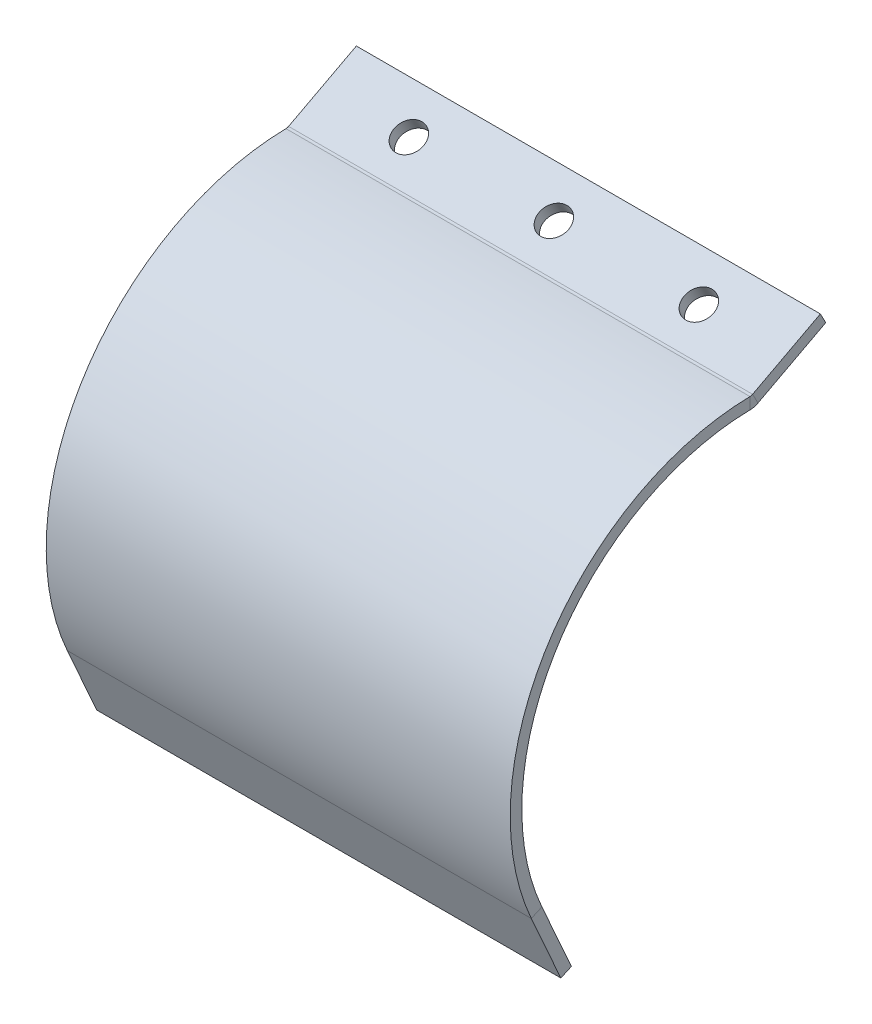
ISO-10303-21;
HEADER;
FILE_DESCRIPTION(('STEP AP214'),'2;1');
FILE_NAME('part.step','',(''),(''),'','','');
FILE_SCHEMA(('AUTOMOTIVE_DESIGN { 1 0 10303 214 1 1 1 1 }'));
ENDSEC;
DATA;
#1=APPLICATION_CONTEXT('core data for automotive mechanical design processes');
#2=APPLICATION_PROTOCOL_DEFINITION('international standard','automotive_design',2000,#1);
#3=PRODUCT_CONTEXT('',#1,'mechanical');
#4=PRODUCT('Part','Part','',(#3));
#5=PRODUCT_RELATED_PRODUCT_CATEGORY('part','',(#4));
#6=PRODUCT_DEFINITION_FORMATION('','',#4);
#7=PRODUCT_DEFINITION_CONTEXT('part definition',#1,'design');
#8=PRODUCT_DEFINITION('design','',#6,#7);
#9=PRODUCT_DEFINITION_SHAPE('','',#8);
#10=(LENGTH_UNIT() NAMED_UNIT(*) SI_UNIT(.MILLI.,.METRE.));
#11=(NAMED_UNIT(*) PLANE_ANGLE_UNIT() SI_UNIT($,.RADIAN.));
#12=(NAMED_UNIT(*) SI_UNIT($,.STERADIAN.) SOLID_ANGLE_UNIT());
#13=UNCERTAINTY_MEASURE_WITH_UNIT(LENGTH_MEASURE(1.E-05),#10,'distance_accuracy_value','');
#14=(GEOMETRIC_REPRESENTATION_CONTEXT(3) GLOBAL_UNCERTAINTY_ASSIGNED_CONTEXT((#13)) GLOBAL_UNIT_ASSIGNED_CONTEXT((#10,
#11,#12)) REPRESENTATION_CONTEXT('',''));
#15=CARTESIAN_POINT('',(0.,0.,0.));
#16=DIRECTION('',(0.,0.,1.));
#17=DIRECTION('',(1.,0.,0.));
#18=AXIS2_PLACEMENT_3D('',#15,#16,#17);
#19=CARTESIAN_POINT('',(80.,-8.33097741460882,-104.091630430719));
#20=DIRECTION('',(0.,0.9135454576426,0.406736643075803));
#21=DIRECTION('',(0.,-0.406736643075803,0.9135454576426));
#22=AXIS2_PLACEMENT_3D('',#19,#20,#21);
#23=PLANE('',#22);
#24=DIRECTION('',(0.,-0.406736643075803,0.9135454576426));
#25=VECTOR('',#24,1.);
#26=CARTESIAN_POINT('',(80.,-8.33097741460882,-104.091630430719));
#27=LINE('',#26,#25);
#28=CARTESIAN_POINT('',(80.,-74.2,43.8526165571953));
#29=VERTEX_POINT('',#28);
#30=CARTESIAN_POINT('',(80.,-75.0134732861516,45.6797074724806));
#31=VERTEX_POINT('',#30);
#32=EDGE_CURVE('E153',#29,#31,#27,.T.);
#33=ORIENTED_EDGE('',*,*,#32,.T.);
#34=DIRECTION('',(-1.,0.,0.));
#35=VECTOR('',#34,1.);
#36=CARTESIAN_POINT('',(80.,-75.0134732861516,45.6797074724806));
#37=LINE('',#36,#35);
#38=CARTESIAN_POINT('',(0.,-75.0134732861516,45.6797074724805));
#39=VERTEX_POINT('',#38);
#40=EDGE_CURVE('E145',#31,#39,#37,.T.);
#41=ORIENTED_EDGE('',*,*,#40,.T.);
#42=DIRECTION('',(0.,-0.406736643075803,0.9135454576426));
#43=VECTOR('',#42,1.);
#44=CARTESIAN_POINT('',(0.,-8.33097741460882,-104.091630430719));
#45=LINE('',#44,#43);
#46=CARTESIAN_POINT('',(0.,-74.2,43.8526165571954));
#47=VERTEX_POINT('',#46);
#48=EDGE_CURVE('E75',#47,#39,#45,.T.);
#49=ORIENTED_EDGE('',*,*,#48,.F.);
#50=DIRECTION('',(-1.,0.,0.));
#51=VECTOR('',#50,1.);
#52=CARTESIAN_POINT('',(80.,-74.2,43.8526165571954));
#53=LINE('',#52,#51);
#54=EDGE_CURVE('E11',#29,#47,#53,.T.);
#55=ORIENTED_EDGE('',*,*,#54,.F.);
#56=EDGE_LOOP('',(#33,#41,#49,#55));
#57=FACE_BOUND('',#56,.T.);
#58=ADVANCED_FACE('F37',(#57),#23,.F.);
#59=CARTESIAN_POINT('',(80.,3.09955686235903,-99.0024286822107));
#60=DIRECTION('',(-1.,0.,0.));
#61=DIRECTION('',(0.,-0.99780146829205,0.0662739003999978));
#62=AXIS2_PLACEMENT_3D('',#59,#60,#61);
#63=PLANE('',#62);
#64=DIRECTION('',(0.,-0.406736643075803,0.9135454576426));
#65=VECTOR('',#64,1.);
#66=CARTESIAN_POINT('',(80.,3.09955686235905,-99.0024286822107));
#67=LINE('',#66,#65);
#68=CARTESIAN_POINT('',(80.,-62.7694657230321,48.941818305704));
#69=VERTEX_POINT('',#68);
#70=CARTESIAN_POINT('',(80.,-63.5829390091838,50.7689092209892));
#71=VERTEX_POINT('',#70);
#72=EDGE_CURVE('E136',#69,#71,#67,.T.);
#73=ORIENTED_EDGE('',*,*,#72,.T.);
#74=DIRECTION('',(0.,-0.9135454576426,-0.406736643075803));
#75=VECTOR('',#74,1.);
#76=CARTESIAN_POINT('',(80.,-63.5829390091838,50.7689092209892));
#77=LINE('',#76,#75);
#78=EDGE_CURVE('E143',#71,#31,#77,.T.);
#79=ORIENTED_EDGE('',*,*,#78,.T.);
#80=ORIENTED_EDGE('',*,*,#32,.F.);
#81=DIRECTION('',(0.,-0.9135454576426,-0.406736643075803));
#82=VECTOR('',#81,1.);
#83=CARTESIAN_POINT('',(80.,-62.7694657230322,48.9418183057039));
#84=LINE('',#83,#82);
#85=EDGE_CURVE('E47',#69,#29,#84,.T.);
#86=ORIENTED_EDGE('',*,*,#85,.F.);
#87=EDGE_LOOP('',(#73,#79,#80,#86));
#88=FACE_BOUND('',#87,.T.);
#89=ADVANCED_FACE('F149',(#88),#63,.F.);
#90=CARTESIAN_POINT('',(80.,-63.5829390091838,50.7689092209892));
#91=DIRECTION('',(0.,0.406736643075803,-0.9135454576426));
#92=DIRECTION('',(0.,0.9135454576426,0.406736643075803));
#93=AXIS2_PLACEMENT_3D('',#90,#91,#92);
#94=PLANE('',#93);
#95=DIRECTION('',(0.,-0.9135454576426,-0.406736643075803));
#96=VECTOR('',#95,1.);
#97=CARTESIAN_POINT('',(0.,-63.5829390091838,50.7689092209892));
#98=LINE('',#97,#96);
#99=CARTESIAN_POINT('',(0.,-63.5829390091837,50.7689092209892));
#100=VERTEX_POINT('',#99);
#101=EDGE_CURVE('E129',#100,#39,#98,.T.);
#102=ORIENTED_EDGE('',*,*,#101,.T.);
#103=ORIENTED_EDGE('',*,*,#40,.F.);
#104=ORIENTED_EDGE('',*,*,#78,.F.);
#105=DIRECTION('',(-1.,0.,0.));
#106=VECTOR('',#105,1.);
#107=CARTESIAN_POINT('',(80.,-63.5829390091838,50.7689092209892));
#108=LINE('',#107,#106);
#109=EDGE_CURVE('E122',#71,#100,#108,.T.);
#110=ORIENTED_EDGE('',*,*,#109,.T.);
#111=EDGE_LOOP('',(#102,#103,#104,#110));
#112=FACE_BOUND('',#111,.T.);
#113=ADVANCED_FACE('F144',(#112),#94,.F.);
#114=CARTESIAN_POINT('',(0.,3.09955686235903,-99.0024286822107));
#115=DIRECTION('',(-1.,0.,0.));
#116=DIRECTION('',(0.,-0.99780146829205,0.0662739003999978));
#117=AXIS2_PLACEMENT_3D('',#114,#115,#116);
#118=PLANE('',#117);
#119=ORIENTED_EDGE('',*,*,#101,.F.);
#120=DIRECTION('',(0.,-0.406736643075803,0.9135454576426));
#121=VECTOR('',#120,1.);
#122=CARTESIAN_POINT('',(0.,3.09955686235905,-99.0024286822107));
#123=LINE('',#122,#121);
#124=CARTESIAN_POINT('',(0.,-62.7694657230321,48.941818305704));
#125=VERTEX_POINT('',#124);
#126=EDGE_CURVE('E157',#125,#100,#123,.T.);
#127=ORIENTED_EDGE('',*,*,#126,.F.);
#128=DIRECTION('',(0.,-0.9135454576426,-0.406736643075803));
#129=VECTOR('',#128,1.);
#130=CARTESIAN_POINT('',(0.,-62.7694657230322,48.9418183057039));
#131=LINE('',#130,#129);
#132=EDGE_CURVE('E128',#125,#47,#131,.T.);
#133=ORIENTED_EDGE('',*,*,#132,.T.);
#134=ORIENTED_EDGE('',*,*,#48,.T.);
#135=EDGE_LOOP('',(#119,#127,#133,#134));
#136=FACE_BOUND('',#135,.T.);
#137=ADVANCED_FACE('F174',(#136),#118,.T.);
#138=CARTESIAN_POINT('',(80.,-62.7694657230322,48.9418183057039));
#139=DIRECTION('',(0.,0.406736643075803,-0.9135454576426));
#140=DIRECTION('',(0.,0.9135454576426,0.406736643075803));
#141=AXIS2_PLACEMENT_3D('',#138,#139,#140);
#142=PLANE('',#141);
#143=ORIENTED_EDGE('',*,*,#132,.F.);
#144=DIRECTION('',(-1.,0.,0.));
#145=VECTOR('',#144,1.);
#146=CARTESIAN_POINT('',(80.,-62.7694657230321,48.941818305704));
#147=LINE('',#146,#145);
#148=EDGE_CURVE('E41',#69,#125,#147,.T.);
#149=ORIENTED_EDGE('',*,*,#148,.F.);
#150=ORIENTED_EDGE('',*,*,#85,.T.);
#151=ORIENTED_EDGE('',*,*,#54,.T.);
#152=EDGE_LOOP('',(#143,#149,#150,#151));
#153=FACE_BOUND('',#152,.T.);
#154=ADVANCED_FACE('F39',(#153),#142,.T.);
#155=CARTESIAN_POINT('',(65.,-1.36650649129364,6.88009768540492));
#156=DIRECTION('',(0.,0.884580975215083,0.466386640339892));
#157=DIRECTION('',(0.,-0.466386640339892,0.884580975215083));
#158=AXIS2_PLACEMENT_3D('',#155,#156,#157);
#159=CYLINDRICAL_SURFACE('',#158,2.54999999999998);
#160=CARTESIAN_POINT('',(65.,-3.1356684417238,5.94732440472513));
#161=DIRECTION('',(0.,-0.884580975215083,-0.466386640339892));
#162=DIRECTION('',(0.,0.466386640339892,-0.884580975215084));
#163=AXIS2_PLACEMENT_3D('',#160,#161,#162);
#164=CIRCLE('',#163,2.54999999999998);
#165=CARTESIAN_POINT('',(65.,-1.94638250885709,3.69164291792668));
#166=VERTEX_POINT('',#165);
#167=EDGE_CURVE('E405',#166,#166,#164,.T.);
#168=ORIENTED_EDGE('',*,*,#167,.T.);
#169=EDGE_LOOP('',(#168));
#170=FACE_BOUND('',#169,.T.);
#171=CARTESIAN_POINT('',(65.,-1.36650649129364,6.88009768540492));
#172=DIRECTION('',(0.,0.884580975215083,0.466386640339892));
#173=DIRECTION('',(0.,-0.466386640339892,0.884580975215083));
#174=AXIS2_PLACEMENT_3D('',#171,#172,#173);
#175=CIRCLE('',#174,2.54999999999998);
#176=CARTESIAN_POINT('',(65.,-2.55579242416035,9.13577917220337));
#177=VERTEX_POINT('',#176);
#178=EDGE_CURVE('E451',#177,#177,#175,.T.);
#179=ORIENTED_EDGE('',*,*,#178,.T.);
#180=EDGE_LOOP('',(#179));
#181=FACE_BOUND('',#180,.T.);
#182=ADVANCED_FACE('F178',(#170,#181),#159,.F.);
#183=CARTESIAN_POINT('',(40.,-1.36650649129364,6.88009768540492));
#184=DIRECTION('',(0.,0.884580975215083,0.466386640339892));
#185=DIRECTION('',(0.,-0.466386640339892,0.884580975215083));
#186=AXIS2_PLACEMENT_3D('',#183,#184,#185);
#187=CYLINDRICAL_SURFACE('',#186,2.54999999999999);
#188=CARTESIAN_POINT('',(40.,-3.1356684417238,5.94732440472513));
#189=DIRECTION('',(0.,-0.884580975215083,-0.466386640339892));
#190=DIRECTION('',(0.,0.466386640339892,-0.884580975215084));
#191=AXIS2_PLACEMENT_3D('',#188,#189,#190);
#192=CIRCLE('',#191,2.54999999999999);
#193=CARTESIAN_POINT('',(40.,-1.94638250885709,3.69164291792668));
#194=VERTEX_POINT('',#193);
#195=EDGE_CURVE('E401',#194,#194,#192,.T.);
#196=ORIENTED_EDGE('',*,*,#195,.T.);
#197=EDGE_LOOP('',(#196));
#198=FACE_BOUND('',#197,.T.);
#199=CARTESIAN_POINT('',(40.,-1.36650649129364,6.88009768540492));
#200=DIRECTION('',(0.,0.884580975215083,0.466386640339892));
#201=DIRECTION('',(0.,-0.466386640339892,0.884580975215083));
#202=AXIS2_PLACEMENT_3D('',#199,#200,#201);
#203=CIRCLE('',#202,2.54999999999999);
#204=CARTESIAN_POINT('',(40.,-2.55579242416036,9.13577917220337));
#205=VERTEX_POINT('',#204);
#206=EDGE_CURVE('E447',#205,#205,#203,.T.);
#207=ORIENTED_EDGE('',*,*,#206,.T.);
#208=EDGE_LOOP('',(#207));
#209=FACE_BOUND('',#208,.T.);
#210=ADVANCED_FACE('F183',(#198,#209),#187,.F.);
#211=CARTESIAN_POINT('',(15.,-1.36650649129364,6.88009768540492));
#212=DIRECTION('',(0.,0.884580975215083,0.466386640339892));
#213=DIRECTION('',(0.,-0.466386640339892,0.884580975215083));
#214=AXIS2_PLACEMENT_3D('',#211,#212,#213);
#215=CYLINDRICAL_SURFACE('',#214,2.54999999999999);
#216=CARTESIAN_POINT('',(15.,-3.1356684417238,5.94732440472513));
#217=DIRECTION('',(0.,-0.884580975215083,-0.466386640339892));
#218=DIRECTION('',(0.,0.466386640339892,-0.884580975215084));
#219=AXIS2_PLACEMENT_3D('',#216,#217,#218);
#220=CIRCLE('',#219,2.54999999999999);
#221=CARTESIAN_POINT('',(15.,-1.94638250885709,3.69164291792668));
#222=VERTEX_POINT('',#221);
#223=EDGE_CURVE('E397',#222,#222,#220,.T.);
#224=ORIENTED_EDGE('',*,*,#223,.T.);
#225=EDGE_LOOP('',(#224));
#226=FACE_BOUND('',#225,.T.);
#227=CARTESIAN_POINT('',(15.,-1.36650649129364,6.88009768540492));
#228=DIRECTION('',(0.,0.884580975215083,0.466386640339892));
#229=DIRECTION('',(0.,-0.466386640339892,0.884580975215083));
#230=AXIS2_PLACEMENT_3D('',#227,#228,#229);
#231=CIRCLE('',#230,2.54999999999999);
#232=CARTESIAN_POINT('',(15.,-2.55579242416036,9.13577917220337));
#233=VERTEX_POINT('',#232);
#234=EDGE_CURVE('E443',#233,#233,#231,.T.);
#235=ORIENTED_EDGE('',*,*,#234,.T.);
#236=EDGE_LOOP('',(#235));
#237=FACE_BOUND('',#236,.T.);
#238=ADVANCED_FACE('F220',(#226,#237),#215,.F.);
#239=CARTESIAN_POINT('',(80.,143.44838529191,75.6317537376489));
#240=DIRECTION('',(0.,-0.466386640339892,0.884580975215083));
#241=DIRECTION('',(0.,-0.884580975215084,-0.466386640339892));
#242=AXIS2_PLACEMENT_3D('',#239,#240,#241);
#243=PLANE('',#242);
#244=DIRECTION('',(-1.,0.,0.));
#245=VECTOR('',#244,1.);
#246=CARTESIAN_POINT('',(80.,0.,0.));
#247=LINE('',#246,#245);
#248=CARTESIAN_POINT('',(80.,0.,0.));
#249=VERTEX_POINT('',#248);
#250=CARTESIAN_POINT('',(0.,0.,0.));
#251=VERTEX_POINT('',#250);
#252=EDGE_CURVE('E415',#249,#251,#247,.T.);
#253=ORIENTED_EDGE('',*,*,#252,.T.);
#254=DIRECTION('',(0.,-0.884580975215083,-0.466386640339892));
#255=VECTOR('',#254,1.);
#256=CARTESIAN_POINT('',(0.,143.44838529191,75.6317537376489));
#257=LINE('',#256,#255);
#258=CARTESIAN_POINT('',(0.,1.76916195043017,0.932773280679784));
#259=VERTEX_POINT('',#258);
#260=EDGE_CURVE('E435',#259,#251,#257,.T.);
#261=ORIENTED_EDGE('',*,*,#260,.F.);
#262=DIRECTION('',(-1.,0.,0.));
#263=VECTOR('',#262,1.);
#264=CARTESIAN_POINT('',(80.,1.76916195043017,0.932773280679784));
#265=LINE('',#264,#263);
#266=CARTESIAN_POINT('',(80.,1.76916195043014,0.932773280679769));
#267=VERTEX_POINT('',#266);
#268=EDGE_CURVE('E427',#267,#259,#265,.T.);
#269=ORIENTED_EDGE('',*,*,#268,.F.);
#270=DIRECTION('',(0.,-0.884580975215083,-0.466386640339892));
#271=VECTOR('',#270,1.);
#272=CARTESIAN_POINT('',(80.,143.44838529191,75.6317537376489));
#273=LINE('',#272,#271);
#274=EDGE_CURVE('E440',#267,#249,#273,.T.);
#275=ORIENTED_EDGE('',*,*,#274,.T.);
#276=EDGE_LOOP('',(#253,#261,#269,#275));
#277=FACE_BOUND('',#276,.T.);
#278=ADVANCED_FACE('F215',(#277),#243,.F.);
#279=CARTESIAN_POINT('',(0.,143.44838529191,75.6317537376489));
#280=DIRECTION('',(1.,0.,0.));
#281=DIRECTION('',(0.,0.,-1.));
#282=AXIS2_PLACEMENT_3D('',#279,#280,#281);
#283=PLANE('',#282);
#284=DIRECTION('',(0.,-0.466386640339892,0.884580975215083));
#285=VECTOR('',#284,1.);
#286=CARTESIAN_POINT('',(0.,0.,0.));
#287=LINE('',#286,#285);
#288=CARTESIAN_POINT('',(0.,-6.1591358418114,11.6818405978806));
#289=VERTEX_POINT('',#288);
#290=EDGE_CURVE('E438',#251,#289,#287,.T.);
#291=ORIENTED_EDGE('',*,*,#290,.T.);
#292=DIRECTION('',(0.,-0.884580975215083,-0.466386640339892));
#293=VECTOR('',#292,1.);
#294=CARTESIAN_POINT('',(0.,137.289249450099,87.3135943355295));
#295=LINE('',#294,#293);
#296=CARTESIAN_POINT('',(0.,-4.38997389138123,12.6146138785604));
#297=VERTEX_POINT('',#296);
#298=EDGE_CURVE('E455',#297,#289,#295,.T.);
#299=ORIENTED_EDGE('',*,*,#298,.F.);
#300=DIRECTION('',(0.,-0.466386640339892,0.884580975215084));
#301=VECTOR('',#300,1.);
#302=CARTESIAN_POINT('',(0.,1.76916195043017,0.932773280679784));
#303=LINE('',#302,#301);
#304=EDGE_CURVE('E432',#259,#297,#303,.T.);
#305=ORIENTED_EDGE('',*,*,#304,.F.);
#306=ORIENTED_EDGE('',*,*,#260,.T.);
#307=EDGE_LOOP('',(#291,#299,#305,#306));
#308=FACE_BOUND('',#307,.T.);
#309=ADVANCED_FACE('F219',(#308),#283,.F.);
#310=CARTESIAN_POINT('',(80.,1.76916195043017,0.932773280679784));
#311=DIRECTION('',(0.,-0.884580975215083,-0.466386640339892));
#312=DIRECTION('',(0.,0.466386640339892,-0.884580975215083));
#313=AXIS2_PLACEMENT_3D('',#310,#311,#312);
#314=PLANE('',#313);
#315=ORIENTED_EDGE('',*,*,#234,.F.);
#316=EDGE_LOOP('',(#315));
#317=FACE_BOUND('',#316,.T.);
#318=ORIENTED_EDGE('',*,*,#206,.F.);
#319=EDGE_LOOP('',(#318));
#320=FACE_BOUND('',#319,.T.);
#321=ORIENTED_EDGE('',*,*,#178,.F.);
#322=EDGE_LOOP('',(#321));
#323=FACE_BOUND('',#322,.T.);
#324=ORIENTED_EDGE('',*,*,#304,.T.);
#325=DIRECTION('',(1.,0.,0.));
#326=VECTOR('',#325,1.);
#327=CARTESIAN_POINT('',(80.,-4.38997389138123,12.6146138785604));
#328=LINE('',#327,#326);
#329=CARTESIAN_POINT('',(80.,-4.38997389138123,12.6146138785604));
#330=VERTEX_POINT('',#329);
#331=EDGE_CURVE('E429',#297,#330,#328,.T.);
#332=ORIENTED_EDGE('',*,*,#331,.T.);
#333=DIRECTION('',(0.,-0.466386640339892,0.884580975215084));
#334=VECTOR('',#333,1.);
#335=CARTESIAN_POINT('',(80.,1.76916195043017,0.932773280679784));
#336=LINE('',#335,#334);
#337=EDGE_CURVE('E418',#267,#330,#336,.T.);
#338=ORIENTED_EDGE('',*,*,#337,.F.);
#339=ORIENTED_EDGE('',*,*,#268,.T.);
#340=EDGE_LOOP('',(#324,#332,#338,#339));
#341=FACE_BOUND('',#340,.T.);
#342=ADVANCED_FACE('F229',(#317,#320,#323,#341),#314,.F.);
#343=CARTESIAN_POINT('',(80.,143.44838529191,75.6317537376489));
#344=DIRECTION('',(1.,0.,0.));
#345=DIRECTION('',(0.,0.,-1.));
#346=AXIS2_PLACEMENT_3D('',#343,#344,#345);
#347=PLANE('',#346);
#348=DIRECTION('',(0.,-0.884580975215083,-0.466386640339892));
#349=VECTOR('',#348,1.);
#350=CARTESIAN_POINT('',(80.,137.289249450099,87.3135943355295));
#351=LINE('',#350,#349);
#352=CARTESIAN_POINT('',(80.,-6.1591358418114,11.6818405978806));
#353=VERTEX_POINT('',#352);
#354=EDGE_CURVE('E422',#330,#353,#351,.T.);
#355=ORIENTED_EDGE('',*,*,#354,.T.);
#356=DIRECTION('',(0.,-0.466386640339892,0.884580975215083));
#357=VECTOR('',#356,1.);
#358=CARTESIAN_POINT('',(80.,0.,0.));
#359=LINE('',#358,#357);
#360=EDGE_CURVE('E410',#249,#353,#359,.T.);
#361=ORIENTED_EDGE('',*,*,#360,.F.);
#362=ORIENTED_EDGE('',*,*,#274,.F.);
#363=ORIENTED_EDGE('',*,*,#337,.T.);
#364=EDGE_LOOP('',(#355,#361,#362,#363));
#365=FACE_BOUND('',#364,.T.);
#366=ADVANCED_FACE('F235',(#365),#347,.T.);
#367=CARTESIAN_POINT('',(80.,0.,0.));
#368=DIRECTION('',(0.,-0.884580975215083,-0.466386640339892));
#369=DIRECTION('',(0.,0.466386640339892,-0.884580975215084));
#370=AXIS2_PLACEMENT_3D('',#367,#368,#369);
#371=PLANE('',#370);
#372=ORIENTED_EDGE('',*,*,#223,.F.);
#373=EDGE_LOOP('',(#372));
#374=FACE_BOUND('',#373,.T.);
#375=ORIENTED_EDGE('',*,*,#195,.F.);
#376=EDGE_LOOP('',(#375));
#377=FACE_BOUND('',#376,.T.);
#378=ORIENTED_EDGE('',*,*,#167,.F.);
#379=EDGE_LOOP('',(#378));
#380=FACE_BOUND('',#379,.T.);
#381=ORIENTED_EDGE('',*,*,#360,.T.);
#382=DIRECTION('',(-1.,0.,0.));
#383=VECTOR('',#382,1.);
#384=CARTESIAN_POINT('',(80.,-6.15913584181139,11.6818405978806));
#385=LINE('',#384,#383);
#386=EDGE_CURVE('E413',#353,#289,#385,.T.);
#387=ORIENTED_EDGE('',*,*,#386,.T.);
#388=ORIENTED_EDGE('',*,*,#290,.F.);
#389=ORIENTED_EDGE('',*,*,#252,.F.);
#390=EDGE_LOOP('',(#381,#387,#388,#389));
#391=FACE_BOUND('',#390,.T.);
#392=ADVANCED_FACE('F195',(#374,#377,#380,#391),#371,.T.);
#393=CARTESIAN_POINT('',(80.,-3.50539291616615,13.0810005189003));
#394=DIRECTION('',(1.,0.,0.));
#395=DIRECTION('',(0.,0.,-1.));
#396=AXIS2_PLACEMENT_3D('',#393,#394,#395);
#397=PLANE('',#396);
#398=ORIENTED_EDGE('',*,*,#354,.F.);
#399=CARTESIAN_POINT('',(80.,-3.50539291616615,13.0810005189003));
#400=DIRECTION('',(1.,0.,0.));
#401=DIRECTION('',(0.,0.,-1.));
#402=AXIS2_PLACEMENT_3D('',#399,#400,#401);
#403=CIRCLE('',#402,1.);
#404=CARTESIAN_POINT('',(80.,-4.50526749951112,13.0651632975305));
#405=VERTEX_POINT('',#404);
#406=EDGE_CURVE('E465',#330,#405,#403,.F.);
#407=ORIENTED_EDGE('',*,*,#406,.T.);
#408=DIRECTION('',(0.,-0.999874583344974,-0.0158372213697744));
#409=VECTOR('',#408,1.);
#410=CARTESIAN_POINT('',(80.,-4.50526749951112,13.0651632975305));
#411=LINE('',#410,#409);
#412=CARTESIAN_POINT('',(80.,-6.50501666620106,13.033488854791));
#413=VERTEX_POINT('',#412);
#414=EDGE_CURVE('E139',#405,#413,#411,.T.);
#415=ORIENTED_EDGE('',*,*,#414,.T.);
#416=CARTESIAN_POINT('',(80.,-3.50539291616615,13.0810005189003));
#417=DIRECTION('',(1.,0.,0.));
#418=DIRECTION('',(0.,0.,-1.));
#419=AXIS2_PLACEMENT_3D('',#416,#417,#418);
#420=CIRCLE('',#419,3.);
#421=EDGE_CURVE('E456',#353,#413,#420,.F.);
#422=ORIENTED_EDGE('',*,*,#421,.F.);
#423=EDGE_LOOP('',(#398,#407,#415,#422));
#424=FACE_BOUND('',#423,.T.);
#425=ADVANCED_FACE('F243',(#424),#397,.T.);
#426=CARTESIAN_POINT('',(0.,-3.50539291616615,13.0810005189003));
#427=DIRECTION('',(-1.,0.,0.));
#428=DIRECTION('',(0.,0.,1.));
#429=AXIS2_PLACEMENT_3D('',#426,#427,#428);
#430=PLANE('',#429);
#431=DIRECTION('',(0.,-0.999874583344974,-0.0158372213697744));
#432=VECTOR('',#431,1.);
#433=CARTESIAN_POINT('',(0.,-4.50526749951112,13.0651632975305));
#434=LINE('',#433,#432);
#435=CARTESIAN_POINT('',(0.,-4.50526749951112,13.0651632975305));
#436=VERTEX_POINT('',#435);
#437=CARTESIAN_POINT('',(0.,-6.50501666620107,13.0334888547909));
#438=VERTEX_POINT('',#437);
#439=EDGE_CURVE('E83',#436,#438,#434,.T.);
#440=ORIENTED_EDGE('',*,*,#439,.F.);
#441=CARTESIAN_POINT('',(0.,-3.50539291616615,13.0810005189003));
#442=DIRECTION('',(1.,0.,0.));
#443=DIRECTION('',(0.,0.,-1.));
#444=AXIS2_PLACEMENT_3D('',#441,#442,#443);
#445=CIRCLE('',#444,1.);
#446=EDGE_CURVE('E467',#436,#297,#445,.T.);
#447=ORIENTED_EDGE('',*,*,#446,.T.);
#448=ORIENTED_EDGE('',*,*,#298,.T.);
#449=CARTESIAN_POINT('',(0.,-3.50539291616615,13.0810005189003));
#450=DIRECTION('',(1.,0.,0.));
#451=DIRECTION('',(0.,0.,-1.));
#452=AXIS2_PLACEMENT_3D('',#449,#450,#451);
#453=CIRCLE('',#452,3.);
#454=EDGE_CURVE('E461',#438,#289,#453,.T.);
#455=ORIENTED_EDGE('',*,*,#454,.F.);
#456=EDGE_LOOP('',(#440,#447,#448,#455));
#457=FACE_BOUND('',#456,.T.);
#458=ADVANCED_FACE('F247',(#457),#430,.T.);
#459=CARTESIAN_POINT('',(-135.401194312407,-3.50539291616615,13.0810005189003));
#460=DIRECTION('',(1.,0.,0.));
#461=DIRECTION('',(0.,0.,-1.));
#462=AXIS2_PLACEMENT_3D('',#459,#460,#461);
#463=CYLINDRICAL_SURFACE('',#462,3.);
#464=ORIENTED_EDGE('',*,*,#454,.T.);
#465=ORIENTED_EDGE('',*,*,#386,.F.);
#466=ORIENTED_EDGE('',*,*,#421,.T.);
#467=DIRECTION('',(-1.,0.,0.));
#468=VECTOR('',#467,1.);
#469=CARTESIAN_POINT('',(80.,-6.50501666620106,13.033488854791));
#470=LINE('',#469,#468);
#471=EDGE_CURVE('E168',#413,#438,#470,.T.);
#472=ORIENTED_EDGE('',*,*,#471,.T.);
#473=EDGE_LOOP('',(#464,#465,#466,#472));
#474=FACE_BOUND('',#473,.T.);
#475=ADVANCED_FACE('F255',(#474),#463,.T.);
#476=CARTESIAN_POINT('',(-135.401194312407,-3.50539291616615,13.0810005189003));
#477=DIRECTION('',(1.,0.,0.));
#478=DIRECTION('',(0.,0.,-1.));
#479=AXIS2_PLACEMENT_3D('',#476,#477,#478);
#480=CYLINDRICAL_SURFACE('',#479,1.);
#481=ORIENTED_EDGE('',*,*,#446,.F.);
#482=DIRECTION('',(-1.,0.,0.));
#483=VECTOR('',#482,1.);
#484=CARTESIAN_POINT('',(80.,-4.50526749951112,13.0651632975305));
#485=LINE('',#484,#483);
#486=EDGE_CURVE('E165',#405,#436,#485,.T.);
#487=ORIENTED_EDGE('',*,*,#486,.F.);
#488=ORIENTED_EDGE('',*,*,#406,.F.);
#489=ORIENTED_EDGE('',*,*,#331,.F.);
#490=EDGE_LOOP('',(#481,#487,#488,#489));
#491=FACE_BOUND('',#490,.T.);
#492=ADVANCED_FACE('F262',(#491),#480,.F.);
#493=CARTESIAN_POINT('',(0.,-46.5,12.4));
#494=DIRECTION('',(-1.,0.,0.));
#495=DIRECTION('',(0.,0.,1.));
#496=AXIS2_PLACEMENT_3D('',#493,#494,#495);
#497=PLANE('',#496);
#498=ORIENTED_EDGE('',*,*,#439,.T.);
#499=CARTESIAN_POINT('',(0.,-46.5,12.4));
#500=DIRECTION('',(-1.,0.,0.));
#501=DIRECTION('',(0.,0.,1.));
#502=AXIS2_PLACEMENT_3D('',#499,#500,#501);
#503=CIRCLE('',#502,40.);
#504=EDGE_CURVE('E140',#438,#125,#503,.F.);
#505=ORIENTED_EDGE('',*,*,#504,.T.);
#506=ORIENTED_EDGE('',*,*,#126,.T.);
#507=CARTESIAN_POINT('',(0.,-46.5,12.4));
#508=DIRECTION('',(-1.,0.,0.));
#509=DIRECTION('',(0.,0.,1.));
#510=AXIS2_PLACEMENT_3D('',#507,#508,#509);
#511=CIRCLE('',#510,42.);
#512=EDGE_CURVE('E56',#436,#100,#511,.F.);
#513=ORIENTED_EDGE('',*,*,#512,.F.);
#514=EDGE_LOOP('',(#498,#505,#506,#513));
#515=FACE_BOUND('',#514,.T.);
#516=ADVANCED_FACE('F270',(#515),#497,.T.);
#517=CARTESIAN_POINT('',(80.,-46.5,12.4));
#518=DIRECTION('',(1.,0.,0.));
#519=DIRECTION('',(0.,0.,-1.));
#520=AXIS2_PLACEMENT_3D('',#517,#518,#519);
#521=PLANE('',#520);
#522=ORIENTED_EDGE('',*,*,#72,.F.);
#523=CARTESIAN_POINT('',(80.,-46.5,12.4));
#524=DIRECTION('',(-1.,0.,0.));
#525=DIRECTION('',(0.,0.,1.));
#526=AXIS2_PLACEMENT_3D('',#523,#524,#525);
#527=CIRCLE('',#526,40.);
#528=EDGE_CURVE('E462',#69,#413,#527,.T.);
#529=ORIENTED_EDGE('',*,*,#528,.T.);
#530=ORIENTED_EDGE('',*,*,#414,.F.);
#531=CARTESIAN_POINT('',(80.,-46.5,12.4));
#532=DIRECTION('',(-1.,0.,0.));
#533=DIRECTION('',(0.,0.,1.));
#534=AXIS2_PLACEMENT_3D('',#531,#532,#533);
#535=CIRCLE('',#534,42.);
#536=EDGE_CURVE('E125',#71,#405,#535,.T.);
#537=ORIENTED_EDGE('',*,*,#536,.F.);
#538=EDGE_LOOP('',(#522,#529,#530,#537));
#539=FACE_BOUND('',#538,.T.);
#540=ADVANCED_FACE('F133',(#539),#521,.T.);
#541=CARTESIAN_POINT('',(213.551158555659,-46.5,12.4));
#542=DIRECTION('',(-1.,0.,0.));
#543=DIRECTION('',(0.,0.,1.));
#544=AXIS2_PLACEMENT_3D('',#541,#542,#543);
#545=CYLINDRICAL_SURFACE('',#544,42.);
#546=ORIENTED_EDGE('',*,*,#536,.T.);
#547=ORIENTED_EDGE('',*,*,#486,.T.);
#548=ORIENTED_EDGE('',*,*,#512,.T.);
#549=ORIENTED_EDGE('',*,*,#109,.F.);
#550=EDGE_LOOP('',(#546,#547,#548,#549));
#551=FACE_BOUND('',#550,.T.);
#552=ADVANCED_FACE('F124',(#551),#545,.T.);
#553=CARTESIAN_POINT('',(213.551158555659,-46.5,12.4));
#554=DIRECTION('',(-1.,0.,0.));
#555=DIRECTION('',(0.,0.,1.));
#556=AXIS2_PLACEMENT_3D('',#553,#554,#555);
#557=CYLINDRICAL_SURFACE('',#556,40.);
#558=ORIENTED_EDGE('',*,*,#528,.F.);
#559=ORIENTED_EDGE('',*,*,#148,.T.);
#560=ORIENTED_EDGE('',*,*,#504,.F.);
#561=ORIENTED_EDGE('',*,*,#471,.F.);
#562=EDGE_LOOP('',(#558,#559,#560,#561));
#563=FACE_BOUND('',#562,.T.);
#564=ADVANCED_FACE('F290',(#563),#557,.F.);
#565=CLOSED_SHELL('',(#58,#89,#113,#137,#154,#182,#210,#238,#278,#309,#342,#366,#392,#425,#458,
#475,#492,#516,#540,#552,#564));
#566=MANIFOLD_SOLID_BREP('B2',#565);
#567=ADVANCED_BREP_SHAPE_REPRESENTATION('',(#18,#566),#14);
#568=SHAPE_DEFINITION_REPRESENTATION(#9,#567);
ENDSEC;
END-ISO-10303-21;
